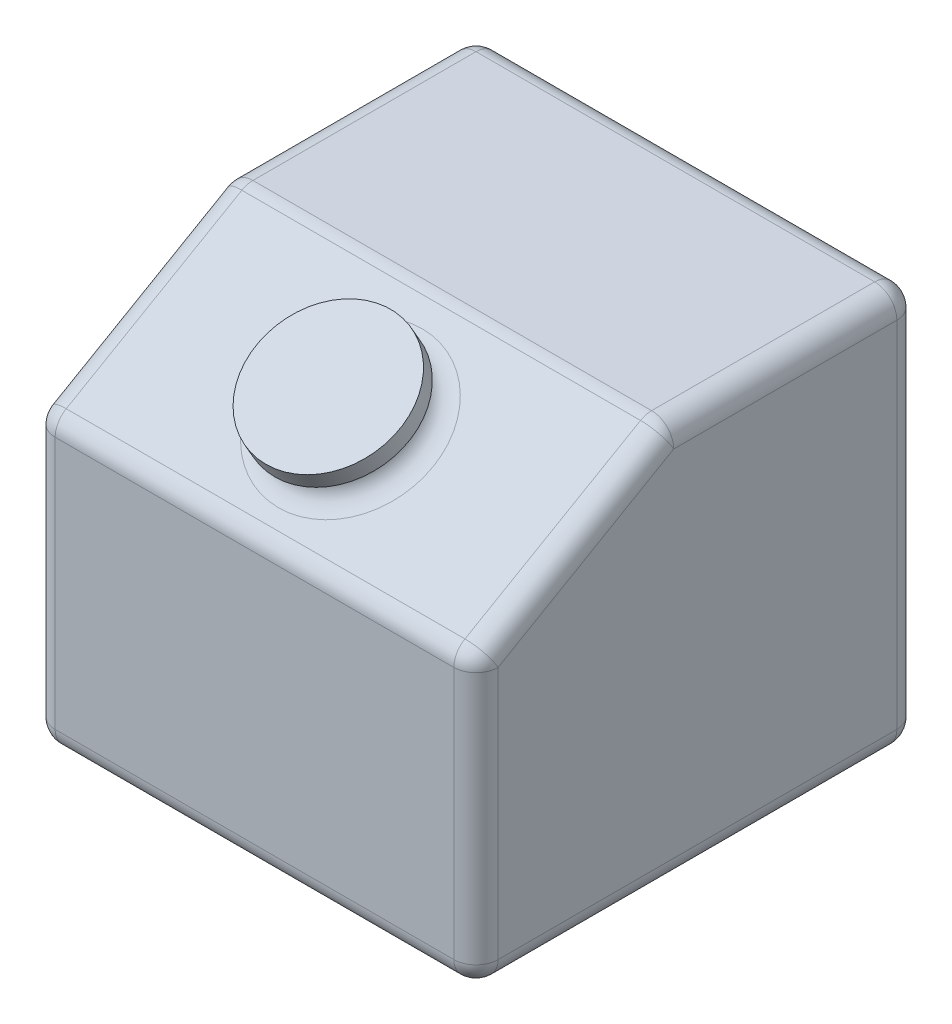
ISO-10303-21;
HEADER;
FILE_DESCRIPTION(('STEP AP214'),'2;1');
FILE_NAME('part.step','',(''),(''),'','','');
FILE_SCHEMA(('AUTOMOTIVE_DESIGN { 1 0 10303 214 1 1 1 1 }'));
ENDSEC;
DATA;
#1=APPLICATION_CONTEXT('core data for automotive mechanical design processes');
#2=APPLICATION_PROTOCOL_DEFINITION('international standard','automotive_design',2000,#1);
#3=PRODUCT_CONTEXT('',#1,'mechanical');
#4=PRODUCT('Part','Part','',(#3));
#5=PRODUCT_RELATED_PRODUCT_CATEGORY('part','',(#4));
#6=PRODUCT_DEFINITION_FORMATION('','',#4);
#7=PRODUCT_DEFINITION_CONTEXT('part definition',#1,'design');
#8=PRODUCT_DEFINITION('design','',#6,#7);
#9=PRODUCT_DEFINITION_SHAPE('','',#8);
#10=(LENGTH_UNIT() NAMED_UNIT(*) SI_UNIT(.MILLI.,.METRE.));
#11=(NAMED_UNIT(*) PLANE_ANGLE_UNIT() SI_UNIT($,.RADIAN.));
#12=(NAMED_UNIT(*) SI_UNIT($,.STERADIAN.) SOLID_ANGLE_UNIT());
#13=UNCERTAINTY_MEASURE_WITH_UNIT(LENGTH_MEASURE(1.E-05),#10,'distance_accuracy_value','');
#14=(GEOMETRIC_REPRESENTATION_CONTEXT(3) GLOBAL_UNCERTAINTY_ASSIGNED_CONTEXT((#13)) GLOBAL_UNIT_ASSIGNED_CONTEXT((#10,
#11,#12)) REPRESENTATION_CONTEXT('',''));
#15=CARTESIAN_POINT('',(0.,0.,0.));
#16=DIRECTION('',(0.,0.,1.));
#17=DIRECTION('',(1.,0.,0.));
#18=AXIS2_PLACEMENT_3D('',#15,#16,#17);
#19=CARTESIAN_POINT('',(100.,172.320508075689,-33.3012701892218));
#20=DIRECTION('',(0.,-0.866025403784438,-0.500000000000001));
#21=DIRECTION('',(0.,0.500000000000001,-0.866025403784438));
#22=AXIS2_PLACEMENT_3D('',#19,#20,#21);
#23=CYLINDRICAL_SURFACE('',#22,27.5);
#24=CARTESIAN_POINT('',(100.,163.660254037844,-38.3012701892219));
#25=DIRECTION('',(0.,-0.866025403784438,-0.500000000000001));
#26=DIRECTION('',(0.,0.500000000000001,-0.866025403784438));
#27=AXIS2_PLACEMENT_3D('',#24,#25,#26);
#28=CIRCLE('',#27,27.5);
#29=CARTESIAN_POINT('',(100.,177.410254037844,-62.1169687932939));
#30=VERTEX_POINT('',#29);
#31=EDGE_CURVE('E232',#30,#30,#28,.F.);
#32=ORIENTED_EDGE('',*,*,#31,.T.);
#33=EDGE_LOOP('',(#32));
#34=FACE_BOUND('',#33,.T.);
#35=CARTESIAN_POINT('',(100.,165.392304845413,-37.3012701892219));
#36=DIRECTION('',(0.,0.866025403784438,0.500000000000001));
#37=DIRECTION('',(0.,-0.500000000000001,0.866025403784438));
#38=AXIS2_PLACEMENT_3D('',#35,#36,#37);
#39=CIRCLE('',#38,27.5);
#40=CARTESIAN_POINT('',(100.,151.642304845413,-13.4855715851498));
#41=VERTEX_POINT('',#40);
#42=EDGE_CURVE('E226',#41,#41,#39,.T.);
#43=ORIENTED_EDGE('',*,*,#42,.F.);
#44=EDGE_LOOP('',(#43));
#45=FACE_BOUND('',#44,.T.);
#46=ADVANCED_FACE('F36',(#34,#45),#23,.T.);
#47=CARTESIAN_POINT('',(0.,180.,0.));
#48=DIRECTION('',(1.,0.,0.));
#49=DIRECTION('',(0.,0.,-1.));
#50=AXIS2_PLACEMENT_3D('',#47,#48,#49);
#51=PLANE('',#50);
#52=DIRECTION('',(0.,-0.500000000000001,0.866025403784438));
#53=VECTOR('',#52,1.);
#54=CARTESIAN_POINT('',(0.,171.339745962156,-91.6025403784437));
#55=LINE('',#54,#53);
#56=CARTESIAN_POINT('',(0.,124.226497308104,-10.));
#57=VERTEX_POINT('',#56);
#58=CARTESIAN_POINT('',(0.,170.,-89.2820323027549));
#59=VERTEX_POINT('',#58);
#60=EDGE_CURVE('E262',#57,#59,#55,.F.);
#61=ORIENTED_EDGE('',*,*,#60,.T.);
#62=DIRECTION('',(0.,0.,1.));
#63=VECTOR('',#62,1.);
#64=CARTESIAN_POINT('',(0.,170.,0.));
#65=LINE('',#64,#63);
#66=CARTESIAN_POINT('',(0.,170.,-190.));
#67=VERTEX_POINT('',#66);
#68=EDGE_CURVE('E264',#59,#67,#65,.F.);
#69=ORIENTED_EDGE('',*,*,#68,.T.);
#70=DIRECTION('',(0.,-1.,0.));
#71=VECTOR('',#70,1.);
#72=CARTESIAN_POINT('',(0.,180.,-190.));
#73=LINE('',#72,#71);
#74=CARTESIAN_POINT('',(0.,10.,-190.));
#75=VERTEX_POINT('',#74);
#76=EDGE_CURVE('E260',#67,#75,#73,.T.);
#77=ORIENTED_EDGE('',*,*,#76,.T.);
#78=DIRECTION('',(0.,0.,1.));
#79=VECTOR('',#78,1.);
#80=CARTESIAN_POINT('',(0.,10.,0.));
#81=LINE('',#80,#79);
#82=CARTESIAN_POINT('',(0.,10.,-10.));
#83=VERTEX_POINT('',#82);
#84=EDGE_CURVE('E256',#75,#83,#81,.T.);
#85=ORIENTED_EDGE('',*,*,#84,.T.);
#86=DIRECTION('',(0.,-1.,0.));
#87=VECTOR('',#86,1.);
#88=CARTESIAN_POINT('',(0.,180.,-10.));
#89=LINE('',#88,#87);
#90=EDGE_CURVE('E258',#83,#57,#89,.F.);
#91=ORIENTED_EDGE('',*,*,#90,.T.);
#92=EDGE_LOOP('',(#61,#69,#77,#85,#91));
#93=FACE_BOUND('',#92,.T.);
#94=ADVANCED_FACE('F414',(#93),#51,.F.);
#95=CARTESIAN_POINT('',(0.,180.,0.));
#96=DIRECTION('',(0.,0.,-1.));
#97=DIRECTION('',(-1.,0.,0.));
#98=AXIS2_PLACEMENT_3D('',#95,#96,#97);
#99=PLANE('',#98);
#100=DIRECTION('',(1.,0.,0.));
#101=VECTOR('',#100,1.);
#102=CARTESIAN_POINT('',(0.,124.226497308104,0.));
#103=LINE('',#102,#101);
#104=CARTESIAN_POINT('',(190.,124.226497308104,0.));
#105=VERTEX_POINT('',#104);
#106=CARTESIAN_POINT('',(10.,124.226497308104,0.));
#107=VERTEX_POINT('',#106);
#108=EDGE_CURVE('E291',#105,#107,#103,.F.);
#109=ORIENTED_EDGE('',*,*,#108,.T.);
#110=DIRECTION('',(0.,-1.,0.));
#111=VECTOR('',#110,1.);
#112=CARTESIAN_POINT('',(10.,180.,0.));
#113=LINE('',#112,#111);
#114=CARTESIAN_POINT('',(10.,10.,0.));
#115=VERTEX_POINT('',#114);
#116=EDGE_CURVE('E293',#107,#115,#113,.T.);
#117=ORIENTED_EDGE('',*,*,#116,.T.);
#118=DIRECTION('',(1.,0.,0.));
#119=VECTOR('',#118,1.);
#120=CARTESIAN_POINT('',(200.,10.,0.));
#121=LINE('',#120,#119);
#122=CARTESIAN_POINT('',(190.,10.,0.));
#123=VERTEX_POINT('',#122);
#124=EDGE_CURVE('E287',#115,#123,#121,.T.);
#125=ORIENTED_EDGE('',*,*,#124,.T.);
#126=DIRECTION('',(0.,-1.,0.));
#127=VECTOR('',#126,1.);
#128=CARTESIAN_POINT('',(190.,180.,0.));
#129=LINE('',#128,#127);
#130=EDGE_CURVE('E289',#123,#105,#129,.F.);
#131=ORIENTED_EDGE('',*,*,#130,.T.);
#132=EDGE_LOOP('',(#109,#117,#125,#131));
#133=FACE_BOUND('',#132,.T.);
#134=ADVANCED_FACE('F393',(#133),#99,.F.);
#135=CARTESIAN_POINT('',(200.,180.,0.));
#136=DIRECTION('',(-1.,0.,0.));
#137=DIRECTION('',(0.,0.,1.));
#138=AXIS2_PLACEMENT_3D('',#135,#136,#137);
#139=PLANE('',#138);
#140=DIRECTION('',(0.,-1.,0.));
#141=VECTOR('',#140,1.);
#142=CARTESIAN_POINT('',(200.,180.,-190.));
#143=LINE('',#142,#141);
#144=CARTESIAN_POINT('',(200.,10.,-190.));
#145=VERTEX_POINT('',#144);
#146=CARTESIAN_POINT('',(200.,170.,-190.));
#147=VERTEX_POINT('',#146);
#148=EDGE_CURVE('E282',#145,#147,#143,.F.);
#149=ORIENTED_EDGE('',*,*,#148,.T.);
#150=DIRECTION('',(0.,0.,-1.));
#151=VECTOR('',#150,1.);
#152=CARTESIAN_POINT('',(200.,170.,0.));
#153=LINE('',#152,#151);
#154=CARTESIAN_POINT('',(200.,170.,-89.282032302755));
#155=VERTEX_POINT('',#154);
#156=EDGE_CURVE('E285',#147,#155,#153,.F.);
#157=ORIENTED_EDGE('',*,*,#156,.T.);
#158=DIRECTION('',(0.,0.500000000000001,-0.866025403784438));
#159=VECTOR('',#158,1.);
#160=CARTESIAN_POINT('',(200.,121.339745962156,-5.));
#161=LINE('',#160,#159);
#162=CARTESIAN_POINT('',(200.,124.226497308104,-10.));
#163=VERTEX_POINT('',#162);
#164=EDGE_CURVE('E280',#155,#163,#161,.F.);
#165=ORIENTED_EDGE('',*,*,#164,.T.);
#166=DIRECTION('',(0.,-1.,0.));
#167=VECTOR('',#166,1.);
#168=CARTESIAN_POINT('',(200.,180.,-10.));
#169=LINE('',#168,#167);
#170=CARTESIAN_POINT('',(200.,10.,-10.));
#171=VERTEX_POINT('',#170);
#172=EDGE_CURVE('E278',#163,#171,#169,.T.);
#173=ORIENTED_EDGE('',*,*,#172,.T.);
#174=DIRECTION('',(0.,0.,-1.));
#175=VECTOR('',#174,1.);
#176=CARTESIAN_POINT('',(200.,10.,-200.));
#177=LINE('',#176,#175);
#178=EDGE_CURVE('E276',#171,#145,#177,.T.);
#179=ORIENTED_EDGE('',*,*,#178,.T.);
#180=EDGE_LOOP('',(#149,#157,#165,#173,#179));
#181=FACE_BOUND('',#180,.T.);
#182=ADVANCED_FACE('F491',(#181),#139,.F.);
#183=CARTESIAN_POINT('',(0.,180.,-200.));
#184=DIRECTION('',(0.,0.,1.));
#185=DIRECTION('',(1.,0.,0.));
#186=AXIS2_PLACEMENT_3D('',#183,#184,#185);
#187=PLANE('',#186);
#188=DIRECTION('',(0.,-1.,0.));
#189=VECTOR('',#188,1.);
#190=CARTESIAN_POINT('',(10.,180.,-200.));
#191=LINE('',#190,#189);
#192=CARTESIAN_POINT('',(10.,10.,-200.));
#193=VERTEX_POINT('',#192);
#194=CARTESIAN_POINT('',(10.,170.,-200.));
#195=VERTEX_POINT('',#194);
#196=EDGE_CURVE('E271',#193,#195,#191,.F.);
#197=ORIENTED_EDGE('',*,*,#196,.T.);
#198=DIRECTION('',(-1.,0.,0.));
#199=VECTOR('',#198,1.);
#200=CARTESIAN_POINT('',(0.,170.,-200.));
#201=LINE('',#200,#199);
#202=CARTESIAN_POINT('',(190.,170.,-200.));
#203=VERTEX_POINT('',#202);
#204=EDGE_CURVE('E273',#195,#203,#201,.F.);
#205=ORIENTED_EDGE('',*,*,#204,.T.);
#206=DIRECTION('',(0.,-1.,0.));
#207=VECTOR('',#206,1.);
#208=CARTESIAN_POINT('',(190.,180.,-200.));
#209=LINE('',#208,#207);
#210=CARTESIAN_POINT('',(190.,10.,-200.));
#211=VERTEX_POINT('',#210);
#212=EDGE_CURVE('E269',#203,#211,#209,.T.);
#213=ORIENTED_EDGE('',*,*,#212,.T.);
#214=DIRECTION('',(-1.,0.,0.));
#215=VECTOR('',#214,1.);
#216=CARTESIAN_POINT('',(0.,10.,-200.));
#217=LINE('',#216,#215);
#218=EDGE_CURVE('E267',#211,#193,#217,.T.);
#219=ORIENTED_EDGE('',*,*,#218,.T.);
#220=EDGE_LOOP('',(#197,#205,#213,#219));
#221=FACE_BOUND('',#220,.T.);
#222=ADVANCED_FACE('F486',(#221),#187,.F.);
#223=CARTESIAN_POINT('',(0.,180.,0.));
#224=DIRECTION('',(0.,-1.,0.));
#225=DIRECTION('',(0.,0.,-1.));
#226=AXIS2_PLACEMENT_3D('',#223,#224,#225);
#227=PLANE('',#226);
#228=DIRECTION('',(0.,0.,1.));
#229=VECTOR('',#228,1.);
#230=CARTESIAN_POINT('',(10.,180.,0.));
#231=LINE('',#230,#229);
#232=CARTESIAN_POINT('',(10.,180.,-190.));
#233=VERTEX_POINT('',#232);
#234=CARTESIAN_POINT('',(10.,180.,-89.282032302755));
#235=VERTEX_POINT('',#234);
#236=EDGE_CURVE('E251',#233,#235,#231,.T.);
#237=ORIENTED_EDGE('',*,*,#236,.T.);
#238=DIRECTION('',(-1.,0.,0.));
#239=VECTOR('',#238,1.);
#240=CARTESIAN_POINT('',(200.,180.,-89.282032302755));
#241=LINE('',#240,#239);
#242=CARTESIAN_POINT('',(190.,180.,-89.282032302755));
#243=VERTEX_POINT('',#242);
#244=EDGE_CURVE('E253',#235,#243,#241,.F.);
#245=ORIENTED_EDGE('',*,*,#244,.T.);
#246=DIRECTION('',(0.,0.,-1.));
#247=VECTOR('',#246,1.);
#248=CARTESIAN_POINT('',(190.,180.,0.));
#249=LINE('',#248,#247);
#250=CARTESIAN_POINT('',(190.,180.,-190.));
#251=VERTEX_POINT('',#250);
#252=EDGE_CURVE('E247',#243,#251,#249,.T.);
#253=ORIENTED_EDGE('',*,*,#252,.T.);
#254=DIRECTION('',(-1.,0.,0.));
#255=VECTOR('',#254,1.);
#256=CARTESIAN_POINT('',(0.,180.,-190.));
#257=LINE('',#256,#255);
#258=EDGE_CURVE('E249',#251,#233,#257,.T.);
#259=ORIENTED_EDGE('',*,*,#258,.T.);
#260=EDGE_LOOP('',(#237,#245,#253,#259));
#261=FACE_BOUND('',#260,.T.);
#262=ADVANCED_FACE('F479',(#261),#227,.F.);
#263=CARTESIAN_POINT('',(0.,0.,0.));
#264=DIRECTION('',(0.,-1.,0.));
#265=DIRECTION('',(0.,0.,-1.));
#266=AXIS2_PLACEMENT_3D('',#263,#264,#265);
#267=PLANE('',#266);
#268=DIRECTION('',(0.,0.,-1.));
#269=VECTOR('',#268,1.);
#270=CARTESIAN_POINT('',(190.,0.,0.));
#271=LINE('',#270,#269);
#272=CARTESIAN_POINT('',(190.,0.,-190.));
#273=VERTEX_POINT('',#272);
#274=CARTESIAN_POINT('',(190.,0.,-10.));
#275=VERTEX_POINT('',#274);
#276=EDGE_CURVE('E45',#273,#275,#271,.F.);
#277=ORIENTED_EDGE('',*,*,#276,.T.);
#278=DIRECTION('',(1.,0.,0.));
#279=VECTOR('',#278,1.);
#280=CARTESIAN_POINT('',(0.,0.,-10.));
#281=LINE('',#280,#279);
#282=CARTESIAN_POINT('',(10.,0.,-10.));
#283=VERTEX_POINT('',#282);
#284=EDGE_CURVE('E11',#275,#283,#281,.F.);
#285=ORIENTED_EDGE('',*,*,#284,.T.);
#286=DIRECTION('',(0.,0.,1.));
#287=VECTOR('',#286,1.);
#288=CARTESIAN_POINT('',(10.,0.,-200.));
#289=LINE('',#288,#287);
#290=CARTESIAN_POINT('',(10.,0.,-190.));
#291=VERTEX_POINT('',#290);
#292=EDGE_CURVE('E296',#283,#291,#289,.F.);
#293=ORIENTED_EDGE('',*,*,#292,.T.);
#294=DIRECTION('',(-1.,0.,0.));
#295=VECTOR('',#294,1.);
#296=CARTESIAN_POINT('',(200.,0.,-190.));
#297=LINE('',#296,#295);
#298=EDGE_CURVE('E56',#291,#273,#297,.F.);
#299=ORIENTED_EDGE('',*,*,#298,.T.);
#300=EDGE_LOOP('',(#277,#285,#293,#299));
#301=FACE_BOUND('',#300,.T.);
#302=ADVANCED_FACE('F516',(#301),#267,.T.);
#303=CARTESIAN_POINT('',(0.,180.,-86.6025403784437));
#304=DIRECTION('',(0.,-0.866025403784438,-0.500000000000001));
#305=DIRECTION('',(1.,0.,0.));
#306=AXIS2_PLACEMENT_3D('',#303,#304,#305);
#307=PLANE('',#306);
#308=CARTESIAN_POINT('',(100.,155.,-43.3012701892219));
#309=DIRECTION('',(0.,-0.866025403784438,-0.500000000000001));
#310=DIRECTION('',(0.,0.500000000000001,-0.866025403784438));
#311=AXIS2_PLACEMENT_3D('',#308,#309,#310);
#312=CIRCLE('',#311,37.5);
#313=CARTESIAN_POINT('',(100.,173.75,-75.7772228311383));
#314=VERTEX_POINT('',#313);
#315=EDGE_CURVE('E244',#314,#314,#312,.T.);
#316=ORIENTED_EDGE('',*,*,#315,.T.);
#317=EDGE_LOOP('',(#316));
#318=FACE_BOUND('',#317,.T.);
#319=DIRECTION('',(0.,-0.500000000000001,0.866025403784438));
#320=VECTOR('',#319,1.);
#321=CARTESIAN_POINT('',(190.,180.,-86.6025403784437));
#322=LINE('',#321,#320);
#323=CARTESIAN_POINT('',(190.,132.886751345948,-4.99999999999998));
#324=VERTEX_POINT('',#323);
#325=CARTESIAN_POINT('',(190.,178.660254037844,-84.2820323027549));
#326=VERTEX_POINT('',#325);
#327=EDGE_CURVE('E237',#324,#326,#322,.F.);
#328=ORIENTED_EDGE('',*,*,#327,.T.);
#329=DIRECTION('',(1.,0.,0.));
#330=VECTOR('',#329,1.);
#331=CARTESIAN_POINT('',(0.,178.660254037844,-84.2820323027549));
#332=LINE('',#331,#330);
#333=CARTESIAN_POINT('',(10.,178.660254037844,-84.2820323027549));
#334=VERTEX_POINT('',#333);
#335=EDGE_CURVE('E241',#326,#334,#332,.F.);
#336=ORIENTED_EDGE('',*,*,#335,.T.);
#337=DIRECTION('',(0.,0.500000000000001,-0.866025403784438));
#338=VECTOR('',#337,1.);
#339=CARTESIAN_POINT('',(10.,130.,0.));
#340=LINE('',#339,#338);
#341=CARTESIAN_POINT('',(10.,132.886751345948,-4.99999999999998));
#342=VERTEX_POINT('',#341);
#343=EDGE_CURVE('E239',#334,#342,#340,.F.);
#344=ORIENTED_EDGE('',*,*,#343,.T.);
#345=DIRECTION('',(-1.,0.,0.));
#346=VECTOR('',#345,1.);
#347=CARTESIAN_POINT('',(200.,132.886751345948,-4.99999999999998));
#348=LINE('',#347,#346);
#349=EDGE_CURVE('E235',#342,#324,#348,.F.);
#350=ORIENTED_EDGE('',*,*,#349,.T.);
#351=EDGE_LOOP('',(#328,#336,#344,#350));
#352=FACE_BOUND('',#351,.T.);
#353=ADVANCED_FACE('F465',(#318,#352),#307,.F.);
#354=CARTESIAN_POINT('',(100.,165.392304845413,-37.3012701892218));
#355=DIRECTION('',(0.,0.866025403784438,0.500000000000001));
#356=DIRECTION('',(0.,-0.500000000000001,0.866025403784438));
#357=AXIS2_PLACEMENT_3D('',#354,#355,#356);
#358=CYLINDRICAL_SURFACE('',#357,32.5);
#359=CARTESIAN_POINT('',(100.,165.392304845413,-37.3012701892218));
#360=DIRECTION('',(0.,0.866025403784438,0.500000000000001));
#361=DIRECTION('',(0.,-0.500000000000001,0.866025403784438));
#362=AXIS2_PLACEMENT_3D('',#359,#360,#361);
#363=CIRCLE('',#362,32.5);
#364=CARTESIAN_POINT('',(100.,149.142304845413,-9.15544456622762));
#365=VERTEX_POINT('',#364);
#366=EDGE_CURVE('E223',#365,#365,#363,.T.);
#367=ORIENTED_EDGE('',*,*,#366,.T.);
#368=EDGE_LOOP('',(#367));
#369=FACE_BOUND('',#368,.T.);
#370=CARTESIAN_POINT('',(100.,172.320508075689,-33.3012701892218));
#371=DIRECTION('',(0.,0.866025403784438,0.500000000000001));
#372=DIRECTION('',(0.,-0.500000000000001,0.866025403784438));
#373=AXIS2_PLACEMENT_3D('',#370,#371,#372);
#374=CIRCLE('',#373,32.5);
#375=CARTESIAN_POINT('',(100.,156.070508075689,-5.15544456622761));
#376=VERTEX_POINT('',#375);
#377=EDGE_CURVE('E227',#376,#376,#374,.T.);
#378=ORIENTED_EDGE('',*,*,#377,.F.);
#379=EDGE_LOOP('',(#378));
#380=FACE_BOUND('',#379,.T.);
#381=ADVANCED_FACE('F527',(#369,#380),#358,.T.);
#382=CARTESIAN_POINT('',(100.,165.392304845413,-37.3012701892218));
#383=DIRECTION('',(0.,0.866025403784438,0.500000000000001));
#384=DIRECTION('',(0.,-0.500000000000001,0.866025403784438));
#385=AXIS2_PLACEMENT_3D('',#382,#383,#384);
#386=PLANE('',#385);
#387=ORIENTED_EDGE('',*,*,#42,.T.);
#388=EDGE_LOOP('',(#387));
#389=FACE_BOUND('',#388,.T.);
#390=ORIENTED_EDGE('',*,*,#366,.F.);
#391=EDGE_LOOP('',(#390));
#392=FACE_BOUND('',#391,.T.);
#393=ADVANCED_FACE('F786',(#389,#392),#386,.F.);
#394=CARTESIAN_POINT('',(0.,114.820508075689,66.2916512459886));
#395=DIRECTION('',(0.,0.866025403784438,0.500000000000001));
#396=DIRECTION('',(0.,-0.500000000000002,0.866025403784438));
#397=AXIS2_PLACEMENT_3D('',#394,#395,#396);
#398=PLANE('',#397);
#399=ORIENTED_EDGE('',*,*,#377,.T.);
#400=EDGE_LOOP('',(#399));
#401=FACE_BOUND('',#400,.T.);
#402=ADVANCED_FACE('F512',(#401),#398,.T.);
#403=CARTESIAN_POINT('',(100.,163.660254037844,-38.3012701892219));
#404=DIRECTION('',(0.,-0.866025403784438,-0.500000000000001));
#405=DIRECTION('',(0.,0.500000000000001,-0.866025403784438));
#406=AXIS2_PLACEMENT_3D('',#403,#404,#405);
#407=TOROIDAL_SURFACE('',#406,37.5,10.);
#408=ORIENTED_EDGE('',*,*,#315,.F.);
#409=EDGE_LOOP('',(#408));
#410=FACE_BOUND('',#409,.T.);
#411=ORIENTED_EDGE('',*,*,#31,.F.);
#412=EDGE_LOOP('',(#411));
#413=FACE_BOUND('',#412,.T.);
#414=ADVANCED_FACE('F529',(#410,#413),#407,.F.);
#415=CARTESIAN_POINT('',(10.,10.,0.));
#416=DIRECTION('',(0.,0.,-1.));
#417=DIRECTION('',(-1.,0.,0.));
#418=AXIS2_PLACEMENT_3D('',#415,#416,#417);
#419=CYLINDRICAL_SURFACE('',#418,10.);
#420=CARTESIAN_POINT('',(10.,10.,-190.));
#421=DIRECTION('',(0.,0.,-1.));
#422=DIRECTION('',(-1.,0.,0.));
#423=AXIS2_PLACEMENT_3D('',#420,#421,#422);
#424=CIRCLE('',#423,10.);
#425=EDGE_CURVE('E375',#291,#75,#424,.T.);
#426=ORIENTED_EDGE('',*,*,#425,.F.);
#427=ORIENTED_EDGE('',*,*,#292,.F.);
#428=CARTESIAN_POINT('',(10.,10.,-10.));
#429=DIRECTION('',(0.,0.,1.));
#430=DIRECTION('',(1.,0.,0.));
#431=AXIS2_PLACEMENT_3D('',#428,#429,#430);
#432=CIRCLE('',#431,10.);
#433=EDGE_CURVE('E377',#83,#283,#432,.T.);
#434=ORIENTED_EDGE('',*,*,#433,.F.);
#435=ORIENTED_EDGE('',*,*,#84,.F.);
#436=EDGE_LOOP('',(#426,#427,#434,#435));
#437=FACE_BOUND('',#436,.T.);
#438=ADVANCED_FACE('F38',(#437),#419,.T.);
#439=CARTESIAN_POINT('',(0.,10.,-190.));
#440=DIRECTION('',(1.,0.,0.));
#441=DIRECTION('',(0.,0.,-1.));
#442=AXIS2_PLACEMENT_3D('',#439,#440,#441);
#443=CYLINDRICAL_SURFACE('',#442,10.);
#444=CARTESIAN_POINT('',(190.,10.,-190.));
#445=DIRECTION('',(1.,0.,0.));
#446=DIRECTION('',(0.,0.,-1.));
#447=AXIS2_PLACEMENT_3D('',#444,#445,#446);
#448=CIRCLE('',#447,10.);
#449=EDGE_CURVE('E369',#273,#211,#448,.T.);
#450=ORIENTED_EDGE('',*,*,#449,.F.);
#451=ORIENTED_EDGE('',*,*,#298,.F.);
#452=CARTESIAN_POINT('',(10.,10.,-190.));
#453=DIRECTION('',(-1.,0.,0.));
#454=DIRECTION('',(0.,0.,1.));
#455=AXIS2_PLACEMENT_3D('',#452,#453,#454);
#456=CIRCLE('',#455,10.);
#457=EDGE_CURVE('E372',#193,#291,#456,.T.);
#458=ORIENTED_EDGE('',*,*,#457,.F.);
#459=ORIENTED_EDGE('',*,*,#218,.F.);
#460=EDGE_LOOP('',(#450,#451,#458,#459));
#461=FACE_BOUND('',#460,.T.);
#462=ADVANCED_FACE('F439',(#461),#443,.T.);
#463=CARTESIAN_POINT('',(190.,10.,0.));
#464=DIRECTION('',(0.,0.,1.));
#465=DIRECTION('',(1.,0.,0.));
#466=AXIS2_PLACEMENT_3D('',#463,#464,#465);
#467=CYLINDRICAL_SURFACE('',#466,10.);
#468=CARTESIAN_POINT('',(190.,10.,-10.));
#469=DIRECTION('',(0.,0.,1.));
#470=DIRECTION('',(1.,0.,0.));
#471=AXIS2_PLACEMENT_3D('',#468,#469,#470);
#472=CIRCLE('',#471,10.);
#473=EDGE_CURVE('E363',#275,#171,#472,.T.);
#474=ORIENTED_EDGE('',*,*,#473,.F.);
#475=ORIENTED_EDGE('',*,*,#276,.F.);
#476=CARTESIAN_POINT('',(190.,10.,-190.));
#477=DIRECTION('',(0.,0.,-1.));
#478=DIRECTION('',(-1.,0.,0.));
#479=AXIS2_PLACEMENT_3D('',#476,#477,#478);
#480=CIRCLE('',#479,10.);
#481=EDGE_CURVE('E366',#145,#273,#480,.T.);
#482=ORIENTED_EDGE('',*,*,#481,.F.);
#483=ORIENTED_EDGE('',*,*,#178,.F.);
#484=EDGE_LOOP('',(#474,#475,#482,#483));
#485=FACE_BOUND('',#484,.T.);
#486=ADVANCED_FACE('F448',(#485),#467,.T.);
#487=CARTESIAN_POINT('',(0.,10.,-10.));
#488=DIRECTION('',(-1.,0.,0.));
#489=DIRECTION('',(0.,0.,1.));
#490=AXIS2_PLACEMENT_3D('',#487,#488,#489);
#491=CYLINDRICAL_SURFACE('',#490,10.);
#492=CARTESIAN_POINT('',(10.,10.,-10.));
#493=DIRECTION('',(-1.,0.,0.));
#494=DIRECTION('',(0.,0.,1.));
#495=AXIS2_PLACEMENT_3D('',#492,#493,#494);
#496=CIRCLE('',#495,10.);
#497=EDGE_CURVE('E40',#283,#115,#496,.T.);
#498=ORIENTED_EDGE('',*,*,#497,.F.);
#499=ORIENTED_EDGE('',*,*,#284,.F.);
#500=CARTESIAN_POINT('',(190.,10.,-10.));
#501=DIRECTION('',(1.,0.,0.));
#502=DIRECTION('',(0.,0.,-1.));
#503=AXIS2_PLACEMENT_3D('',#500,#501,#502);
#504=CIRCLE('',#503,10.);
#505=EDGE_CURVE('E360',#123,#275,#504,.T.);
#506=ORIENTED_EDGE('',*,*,#505,.F.);
#507=ORIENTED_EDGE('',*,*,#124,.F.);
#508=EDGE_LOOP('',(#498,#499,#506,#507));
#509=FACE_BOUND('',#508,.T.);
#510=ADVANCED_FACE('F389',(#509),#491,.T.);
#511=CARTESIAN_POINT('',(10.,10.,-10.));
#512=DIRECTION('',(0.,0.,1.));
#513=DIRECTION('',(1.,0.,0.));
#514=AXIS2_PLACEMENT_3D('',#511,#512,#513);
#515=SPHERICAL_SURFACE('',#514,10.);
#516=ORIENTED_EDGE('',*,*,#433,.T.);
#517=ORIENTED_EDGE('',*,*,#497,.T.);
#518=CARTESIAN_POINT('',(10.,10.,-10.));
#519=DIRECTION('',(0.,-1.,0.));
#520=DIRECTION('',(0.,0.,-1.));
#521=AXIS2_PLACEMENT_3D('',#518,#519,#520);
#522=CIRCLE('',#521,10.);
#523=EDGE_CURVE('E358',#83,#115,#522,.F.);
#524=ORIENTED_EDGE('',*,*,#523,.F.);
#525=EDGE_LOOP('',(#516,#517,#524));
#526=FACE_BOUND('',#525,.T.);
#527=ADVANCED_FACE('F384',(#526),#515,.T.);
#528=CARTESIAN_POINT('',(10.,10.,-190.));
#529=DIRECTION('',(0.,0.,1.));
#530=DIRECTION('',(1.,0.,0.));
#531=AXIS2_PLACEMENT_3D('',#528,#529,#530);
#532=SPHERICAL_SURFACE('',#531,10.);
#533=ORIENTED_EDGE('',*,*,#457,.T.);
#534=ORIENTED_EDGE('',*,*,#425,.T.);
#535=CARTESIAN_POINT('',(10.,10.,-190.));
#536=DIRECTION('',(0.,-1.,0.));
#537=DIRECTION('',(0.,0.,-1.));
#538=AXIS2_PLACEMENT_3D('',#535,#536,#537);
#539=CIRCLE('',#538,10.);
#540=EDGE_CURVE('E355',#193,#75,#539,.F.);
#541=ORIENTED_EDGE('',*,*,#540,.F.);
#542=EDGE_LOOP('',(#533,#534,#541));
#543=FACE_BOUND('',#542,.T.);
#544=ADVANCED_FACE('F434',(#543),#532,.T.);
#545=CARTESIAN_POINT('',(190.,10.,-190.));
#546=DIRECTION('',(0.,0.,1.));
#547=DIRECTION('',(1.,0.,0.));
#548=AXIS2_PLACEMENT_3D('',#545,#546,#547);
#549=SPHERICAL_SURFACE('',#548,10.);
#550=ORIENTED_EDGE('',*,*,#481,.T.);
#551=ORIENTED_EDGE('',*,*,#449,.T.);
#552=CARTESIAN_POINT('',(190.,10.,-190.));
#553=DIRECTION('',(0.,-1.,0.));
#554=DIRECTION('',(0.,0.,-1.));
#555=AXIS2_PLACEMENT_3D('',#552,#553,#554);
#556=CIRCLE('',#555,10.);
#557=EDGE_CURVE('E352',#145,#211,#556,.F.);
#558=ORIENTED_EDGE('',*,*,#557,.F.);
#559=EDGE_LOOP('',(#550,#551,#558));
#560=FACE_BOUND('',#559,.T.);
#561=ADVANCED_FACE('F443',(#560),#549,.T.);
#562=CARTESIAN_POINT('',(190.,10.,-10.));
#563=DIRECTION('',(0.,0.,1.));
#564=DIRECTION('',(1.,0.,0.));
#565=AXIS2_PLACEMENT_3D('',#562,#563,#564);
#566=SPHERICAL_SURFACE('',#565,10.);
#567=ORIENTED_EDGE('',*,*,#505,.T.);
#568=ORIENTED_EDGE('',*,*,#473,.T.);
#569=CARTESIAN_POINT('',(190.,10.,-10.));
#570=DIRECTION('',(0.,-1.,0.));
#571=DIRECTION('',(0.,0.,-1.));
#572=AXIS2_PLACEMENT_3D('',#569,#570,#571);
#573=CIRCLE('',#572,10.);
#574=EDGE_CURVE('E349',#123,#171,#573,.F.);
#575=ORIENTED_EDGE('',*,*,#574,.F.);
#576=EDGE_LOOP('',(#567,#568,#575));
#577=FACE_BOUND('',#576,.T.);
#578=ADVANCED_FACE('F450',(#577),#566,.T.);
#579=CARTESIAN_POINT('',(10.,180.,-10.));
#580=DIRECTION('',(0.,-1.,0.));
#581=DIRECTION('',(0.,0.,-1.));
#582=AXIS2_PLACEMENT_3D('',#579,#580,#581);
#583=CYLINDRICAL_SURFACE('',#582,10.);
#584=ORIENTED_EDGE('',*,*,#523,.T.);
#585=ORIENTED_EDGE('',*,*,#116,.F.);
#586=CARTESIAN_POINT('',(10.,124.226497308104,-10.));
#587=DIRECTION('',(0.,1.,0.));
#588=DIRECTION('',(0.,0.,1.));
#589=AXIS2_PLACEMENT_3D('',#586,#587,#588);
#590=CIRCLE('',#589,10.);
#591=EDGE_CURVE('E343',#57,#107,#590,.T.);
#592=ORIENTED_EDGE('',*,*,#591,.F.);
#593=ORIENTED_EDGE('',*,*,#90,.F.);
#594=EDGE_LOOP('',(#584,#585,#592,#593));
#595=FACE_BOUND('',#594,.T.);
#596=ADVANCED_FACE('F398',(#595),#583,.T.);
#597=CARTESIAN_POINT('',(10.,180.,-190.));
#598=DIRECTION('',(0.,-1.,0.));
#599=DIRECTION('',(0.,0.,-1.));
#600=AXIS2_PLACEMENT_3D('',#597,#598,#599);
#601=CYLINDRICAL_SURFACE('',#600,10.);
#602=ORIENTED_EDGE('',*,*,#540,.T.);
#603=ORIENTED_EDGE('',*,*,#76,.F.);
#604=CARTESIAN_POINT('',(10.,170.,-190.));
#605=DIRECTION('',(0.,1.,0.));
#606=DIRECTION('',(0.,0.,1.));
#607=AXIS2_PLACEMENT_3D('',#604,#605,#606);
#608=CIRCLE('',#607,10.);
#609=EDGE_CURVE('E340',#195,#67,#608,.T.);
#610=ORIENTED_EDGE('',*,*,#609,.F.);
#611=ORIENTED_EDGE('',*,*,#196,.F.);
#612=EDGE_LOOP('',(#602,#603,#610,#611));
#613=FACE_BOUND('',#612,.T.);
#614=ADVANCED_FACE('F428',(#613),#601,.T.);
#615=CARTESIAN_POINT('',(0.,170.,-190.));
#616=DIRECTION('',(-1.,0.,0.));
#617=DIRECTION('',(0.,0.,1.));
#618=AXIS2_PLACEMENT_3D('',#615,#616,#617);
#619=CYLINDRICAL_SURFACE('',#618,10.);
#620=CARTESIAN_POINT('',(190.,170.,-190.));
#621=DIRECTION('',(1.,0.,0.));
#622=DIRECTION('',(0.,0.,-1.));
#623=AXIS2_PLACEMENT_3D('',#620,#621,#622);
#624=CIRCLE('',#623,10.);
#625=EDGE_CURVE('E334',#203,#251,#624,.T.);
#626=ORIENTED_EDGE('',*,*,#625,.F.);
#627=ORIENTED_EDGE('',*,*,#204,.F.);
#628=CARTESIAN_POINT('',(10.,170.,-190.));
#629=DIRECTION('',(-1.,0.,0.));
#630=DIRECTION('',(0.,0.,1.));
#631=AXIS2_PLACEMENT_3D('',#628,#629,#630);
#632=CIRCLE('',#631,10.);
#633=EDGE_CURVE('E337',#233,#195,#632,.T.);
#634=ORIENTED_EDGE('',*,*,#633,.F.);
#635=ORIENTED_EDGE('',*,*,#258,.F.);
#636=EDGE_LOOP('',(#626,#627,#634,#635));
#637=FACE_BOUND('',#636,.T.);
#638=ADVANCED_FACE('F483',(#637),#619,.T.);
#639=CARTESIAN_POINT('',(190.,180.,-190.));
#640=DIRECTION('',(0.,-1.,0.));
#641=DIRECTION('',(0.,0.,-1.));
#642=AXIS2_PLACEMENT_3D('',#639,#640,#641);
#643=CYLINDRICAL_SURFACE('',#642,10.);
#644=ORIENTED_EDGE('',*,*,#557,.T.);
#645=ORIENTED_EDGE('',*,*,#212,.F.);
#646=CARTESIAN_POINT('',(190.,170.,-190.));
#647=DIRECTION('',(0.,1.,0.));
#648=DIRECTION('',(0.,0.,1.));
#649=AXIS2_PLACEMENT_3D('',#646,#647,#648);
#650=CIRCLE('',#649,10.);
#651=EDGE_CURVE('E332',#147,#203,#650,.T.);
#652=ORIENTED_EDGE('',*,*,#651,.F.);
#653=ORIENTED_EDGE('',*,*,#148,.F.);
#654=EDGE_LOOP('',(#644,#645,#652,#653));
#655=FACE_BOUND('',#654,.T.);
#656=ADVANCED_FACE('F489',(#655),#643,.T.);
#657=CARTESIAN_POINT('',(190.,180.,-10.));
#658=DIRECTION('',(0.,-1.,0.));
#659=DIRECTION('',(0.,0.,-1.));
#660=AXIS2_PLACEMENT_3D('',#657,#658,#659);
#661=CYLINDRICAL_SURFACE('',#660,10.);
#662=ORIENTED_EDGE('',*,*,#574,.T.);
#663=ORIENTED_EDGE('',*,*,#172,.F.);
#664=CARTESIAN_POINT('',(190.,124.226497308104,-10.));
#665=DIRECTION('',(0.,1.,0.));
#666=DIRECTION('',(-1.,0.,0.));
#667=AXIS2_PLACEMENT_3D('',#664,#665,#666);
#668=CIRCLE('',#667,10.);
#669=EDGE_CURVE('E329',#105,#163,#668,.T.);
#670=ORIENTED_EDGE('',*,*,#669,.F.);
#671=ORIENTED_EDGE('',*,*,#130,.F.);
#672=EDGE_LOOP('',(#662,#663,#670,#671));
#673=FACE_BOUND('',#672,.T.);
#674=ADVANCED_FACE('F454',(#673),#661,.T.);
#675=CARTESIAN_POINT('',(0.,124.226497308104,-10.));
#676=DIRECTION('',(-1.,0.,0.));
#677=DIRECTION('',(0.,0.,1.));
#678=AXIS2_PLACEMENT_3D('',#675,#676,#677);
#679=CYLINDRICAL_SURFACE('',#678,10.);
#680=CARTESIAN_POINT('',(10.,124.226497308104,-10.));
#681=DIRECTION('',(-1.,0.,0.));
#682=DIRECTION('',(0.,-1.,0.));
#683=AXIS2_PLACEMENT_3D('',#680,#681,#682);
#684=CIRCLE('',#683,10.);
#685=EDGE_CURVE('E346',#107,#342,#684,.T.);
#686=ORIENTED_EDGE('',*,*,#685,.F.);
#687=ORIENTED_EDGE('',*,*,#108,.F.);
#688=CARTESIAN_POINT('',(190.,124.226497308104,-9.99999999999999));
#689=DIRECTION('',(1.,0.,0.));
#690=DIRECTION('',(0.,0.,-1.));
#691=AXIS2_PLACEMENT_3D('',#688,#689,#690);
#692=CIRCLE('',#691,10.);
#693=EDGE_CURVE('E326',#324,#105,#692,.T.);
#694=ORIENTED_EDGE('',*,*,#693,.F.);
#695=ORIENTED_EDGE('',*,*,#349,.F.);
#696=EDGE_LOOP('',(#686,#687,#694,#695));
#697=FACE_BOUND('',#696,.T.);
#698=ADVANCED_FACE('F402',(#697),#679,.T.);
#699=CARTESIAN_POINT('',(10.,124.226497308104,-10.));
#700=DIRECTION('',(0.,0.,1.));
#701=DIRECTION('',(1.,0.,0.));
#702=AXIS2_PLACEMENT_3D('',#699,#700,#701);
#703=SPHERICAL_SURFACE('',#702,10.);
#704=ORIENTED_EDGE('',*,*,#591,.T.);
#705=ORIENTED_EDGE('',*,*,#685,.T.);
#706=CARTESIAN_POINT('',(10.,124.226497308104,-9.99999999999999));
#707=DIRECTION('',(0.,-0.500000000000002,0.866025403784438));
#708=DIRECTION('',(0.,-0.866025403784438,-0.500000000000002));
#709=AXIS2_PLACEMENT_3D('',#706,#707,#708);
#710=CIRCLE('',#709,10.);
#711=EDGE_CURVE('E323',#57,#342,#710,.F.);
#712=ORIENTED_EDGE('',*,*,#711,.F.);
#713=EDGE_LOOP('',(#704,#705,#712));
#714=FACE_BOUND('',#713,.T.);
#715=ADVANCED_FACE('F406',(#714),#703,.T.);
#716=CARTESIAN_POINT('',(10.,170.,-190.));
#717=DIRECTION('',(0.,0.,1.));
#718=DIRECTION('',(1.,0.,0.));
#719=AXIS2_PLACEMENT_3D('',#716,#717,#718);
#720=SPHERICAL_SURFACE('',#719,10.);
#721=ORIENTED_EDGE('',*,*,#633,.T.);
#722=ORIENTED_EDGE('',*,*,#609,.T.);
#723=CARTESIAN_POINT('',(10.,170.,-190.));
#724=DIRECTION('',(0.,0.,-1.));
#725=DIRECTION('',(-1.,0.,0.));
#726=AXIS2_PLACEMENT_3D('',#723,#724,#725);
#727=CIRCLE('',#726,10.);
#728=EDGE_CURVE('E321',#233,#67,#727,.F.);
#729=ORIENTED_EDGE('',*,*,#728,.F.);
#730=EDGE_LOOP('',(#721,#722,#729));
#731=FACE_BOUND('',#730,.T.);
#732=ADVANCED_FACE('F424',(#731),#720,.T.);
#733=CARTESIAN_POINT('',(190.,170.,-190.));
#734=DIRECTION('',(0.,0.,1.));
#735=DIRECTION('',(1.,0.,0.));
#736=AXIS2_PLACEMENT_3D('',#733,#734,#735);
#737=SPHERICAL_SURFACE('',#736,10.);
#738=ORIENTED_EDGE('',*,*,#651,.T.);
#739=ORIENTED_EDGE('',*,*,#625,.T.);
#740=CARTESIAN_POINT('',(190.,170.,-190.));
#741=DIRECTION('',(0.,0.,-1.));
#742=DIRECTION('',(-1.,0.,0.));
#743=AXIS2_PLACEMENT_3D('',#740,#741,#742);
#744=CIRCLE('',#743,10.);
#745=EDGE_CURVE('E318',#147,#251,#744,.F.);
#746=ORIENTED_EDGE('',*,*,#745,.F.);
#747=EDGE_LOOP('',(#738,#739,#746));
#748=FACE_BOUND('',#747,.T.);
#749=ADVANCED_FACE('F493',(#748),#737,.T.);
#750=CARTESIAN_POINT('',(190.,124.226497308104,-10.));
#751=DIRECTION('',(0.,0.,1.));
#752=DIRECTION('',(1.,0.,0.));
#753=AXIS2_PLACEMENT_3D('',#750,#751,#752);
#754=SPHERICAL_SURFACE('',#753,10.);
#755=ORIENTED_EDGE('',*,*,#693,.T.);
#756=ORIENTED_EDGE('',*,*,#669,.T.);
#757=CARTESIAN_POINT('',(190.,124.226497308104,-10.));
#758=DIRECTION('',(0.,-0.500000000000002,0.866025403784437));
#759=DIRECTION('',(0.,-0.866025403784437,-0.500000000000002));
#760=AXIS2_PLACEMENT_3D('',#757,#758,#759);
#761=CIRCLE('',#760,10.);
#762=EDGE_CURVE('E315',#324,#163,#761,.F.);
#763=ORIENTED_EDGE('',*,*,#762,.F.);
#764=EDGE_LOOP('',(#755,#756,#763));
#765=FACE_BOUND('',#764,.T.);
#766=ADVANCED_FACE('F457',(#765),#754,.T.);
#767=CARTESIAN_POINT('',(10.,133.839745962156,-26.6506350946111));
#768=DIRECTION('',(0.,0.500000000000001,-0.866025403784438));
#769=DIRECTION('',(0.,0.866025403784438,0.500000000000001));
#770=AXIS2_PLACEMENT_3D('',#767,#768,#769);
#771=CYLINDRICAL_SURFACE('',#770,10.);
#772=ORIENTED_EDGE('',*,*,#711,.T.);
#773=ORIENTED_EDGE('',*,*,#343,.F.);
#774=CARTESIAN_POINT('',(10.,170.,-89.2820323027549));
#775=DIRECTION('',(0.,0.500000000000001,-0.866025403784438));
#776=DIRECTION('',(0.,0.866025403784438,0.500000000000001));
#777=AXIS2_PLACEMENT_3D('',#774,#775,#776);
#778=CIRCLE('',#777,10.);
#779=EDGE_CURVE('E312',#59,#334,#778,.T.);
#780=ORIENTED_EDGE('',*,*,#779,.F.);
#781=ORIENTED_EDGE('',*,*,#60,.F.);
#782=EDGE_LOOP('',(#772,#773,#780,#781));
#783=FACE_BOUND('',#782,.T.);
#784=ADVANCED_FACE('F411',(#783),#771,.T.);
#785=CARTESIAN_POINT('',(10.,170.,0.));
#786=DIRECTION('',(0.,0.,1.));
#787=DIRECTION('',(1.,0.,0.));
#788=AXIS2_PLACEMENT_3D('',#785,#786,#787);
#789=CYLINDRICAL_SURFACE('',#788,10.);
#790=ORIENTED_EDGE('',*,*,#728,.T.);
#791=ORIENTED_EDGE('',*,*,#68,.F.);
#792=CARTESIAN_POINT('',(10.,170.,-89.282032302755));
#793=DIRECTION('',(0.,0.,1.));
#794=DIRECTION('',(1.,0.,0.));
#795=AXIS2_PLACEMENT_3D('',#792,#793,#794);
#796=CIRCLE('',#795,10.);
#797=EDGE_CURVE('E309',#235,#59,#796,.T.);
#798=ORIENTED_EDGE('',*,*,#797,.F.);
#799=ORIENTED_EDGE('',*,*,#236,.F.);
#800=EDGE_LOOP('',(#790,#791,#798,#799));
#801=FACE_BOUND('',#800,.T.);
#802=ADVANCED_FACE('F417',(#801),#789,.T.);
#803=CARTESIAN_POINT('',(190.,170.,0.));
#804=DIRECTION('',(0.,0.,-1.));
#805=DIRECTION('',(-1.,0.,0.));
#806=AXIS2_PLACEMENT_3D('',#803,#804,#805);
#807=CYLINDRICAL_SURFACE('',#806,10.);
#808=ORIENTED_EDGE('',*,*,#745,.T.);
#809=ORIENTED_EDGE('',*,*,#252,.F.);
#810=CARTESIAN_POINT('',(190.,170.,-89.282032302755));
#811=DIRECTION('',(0.,0.,1.));
#812=DIRECTION('',(1.,0.,0.));
#813=AXIS2_PLACEMENT_3D('',#810,#811,#812);
#814=CIRCLE('',#813,10.);
#815=EDGE_CURVE('E306',#155,#243,#814,.T.);
#816=ORIENTED_EDGE('',*,*,#815,.F.);
#817=ORIENTED_EDGE('',*,*,#156,.F.);
#818=EDGE_LOOP('',(#808,#809,#816,#817));
#819=FACE_BOUND('',#818,.T.);
#820=ADVANCED_FACE('F475',(#819),#807,.T.);
#821=CARTESIAN_POINT('',(190.,133.839745962156,-26.6506350946111));
#822=DIRECTION('',(0.,-0.500000000000001,0.866025403784438));
#823=DIRECTION('',(0.,-0.866025403784438,-0.500000000000001));
#824=AXIS2_PLACEMENT_3D('',#821,#822,#823);
#825=CYLINDRICAL_SURFACE('',#824,10.);
#826=ORIENTED_EDGE('',*,*,#762,.T.);
#827=ORIENTED_EDGE('',*,*,#164,.F.);
#828=CARTESIAN_POINT('',(190.,170.,-89.282032302755));
#829=DIRECTION('',(0.,0.500000000000002,-0.866025403784437));
#830=DIRECTION('',(0.,0.866025403784438,0.500000000000002));
#831=AXIS2_PLACEMENT_3D('',#828,#829,#830);
#832=CIRCLE('',#831,10.);
#833=EDGE_CURVE('E303',#326,#155,#832,.T.);
#834=ORIENTED_EDGE('',*,*,#833,.F.);
#835=ORIENTED_EDGE('',*,*,#327,.F.);
#836=EDGE_LOOP('',(#826,#827,#834,#835));
#837=FACE_BOUND('',#836,.T.);
#838=ADVANCED_FACE('F462',(#837),#825,.T.);
#839=CARTESIAN_POINT('',(10.,170.,-89.282032302755));
#840=DIRECTION('',(0.,0.,1.));
#841=DIRECTION('',(1.,0.,0.));
#842=AXIS2_PLACEMENT_3D('',#839,#840,#841);
#843=SPHERICAL_SURFACE('',#842,10.);
#844=ORIENTED_EDGE('',*,*,#797,.T.);
#845=ORIENTED_EDGE('',*,*,#779,.T.);
#846=CARTESIAN_POINT('',(10.,170.,-89.282032302755));
#847=DIRECTION('',(-1.,0.,0.));
#848=DIRECTION('',(0.,0.,1.));
#849=AXIS2_PLACEMENT_3D('',#846,#847,#848);
#850=CIRCLE('',#849,10.);
#851=EDGE_CURVE('E301',#235,#334,#850,.F.);
#852=ORIENTED_EDGE('',*,*,#851,.F.);
#853=EDGE_LOOP('',(#844,#845,#852));
#854=FACE_BOUND('',#853,.T.);
#855=ADVANCED_FACE('F537',(#854),#843,.T.);
#856=CARTESIAN_POINT('',(190.,170.,-89.282032302755));
#857=DIRECTION('',(0.,0.,1.));
#858=DIRECTION('',(1.,0.,0.));
#859=AXIS2_PLACEMENT_3D('',#856,#857,#858);
#860=SPHERICAL_SURFACE('',#859,10.);
#861=ORIENTED_EDGE('',*,*,#833,.T.);
#862=ORIENTED_EDGE('',*,*,#815,.T.);
#863=CARTESIAN_POINT('',(190.,170.,-89.282032302755));
#864=DIRECTION('',(1.,0.,0.));
#865=DIRECTION('',(0.,0.,-1.));
#866=AXIS2_PLACEMENT_3D('',#863,#864,#865);
#867=CIRCLE('',#866,10.);
#868=EDGE_CURVE('E217',#326,#243,#867,.F.);
#869=ORIENTED_EDGE('',*,*,#868,.F.);
#870=EDGE_LOOP('',(#861,#862,#869));
#871=FACE_BOUND('',#870,.T.);
#872=ADVANCED_FACE('F471',(#871),#860,.T.);
#873=CARTESIAN_POINT('',(0.,170.,-89.282032302755));
#874=DIRECTION('',(1.,0.,0.));
#875=DIRECTION('',(0.,0.,-1.));
#876=AXIS2_PLACEMENT_3D('',#873,#874,#875);
#877=CYLINDRICAL_SURFACE('',#876,10.);
#878=ORIENTED_EDGE('',*,*,#851,.T.);
#879=ORIENTED_EDGE('',*,*,#335,.F.);
#880=ORIENTED_EDGE('',*,*,#868,.T.);
#881=ORIENTED_EDGE('',*,*,#244,.F.);
#882=EDGE_LOOP('',(#878,#879,#880,#881));
#883=FACE_BOUND('',#882,.T.);
#884=ADVANCED_FACE('F468',(#883),#877,.T.);
#885=CLOSED_SHELL('',(#46,#94,#134,#182,#222,#262,#302,#353,#381,#393,#402,#414,#438,#462,#486,
#510,#527,#544,#561,#578,#596,#614,#638,#656,#674,#698,#715,#732,#749,#766,#784,#802,#820,#838,
#855,#872,#884));
#886=CARTESIAN_POINT('',(10.,13.,-13.));
#887=DIRECTION('',(0.,-1.,0.));
#888=DIRECTION('',(0.,0.,-1.));
#889=AXIS2_PLACEMENT_3D('',#886,#887,#888);
#890=PLANE('',#889);
#891=DIRECTION('',(0.,0.,-1.));
#892=VECTOR('',#891,1.);
#893=CARTESIAN_POINT('',(190.,13.,-13.));
#894=LINE('',#893,#892);
#895=CARTESIAN_POINT('',(190.,13.,-13.));
#896=VERTEX_POINT('',#895);
#897=CARTESIAN_POINT('',(190.,13.,-187.));
#898=VERTEX_POINT('',#897);
#899=EDGE_CURVE('E179',#896,#898,#894,.T.);
#900=ORIENTED_EDGE('',*,*,#899,.T.);
#901=DIRECTION('',(1.,0.,0.));
#902=VECTOR('',#901,1.);
#903=CARTESIAN_POINT('',(10.,13.,-187.));
#904=LINE('',#903,#902);
#905=CARTESIAN_POINT('',(10.,13.,-187.));
#906=VERTEX_POINT('',#905);
#907=EDGE_CURVE('E172',#906,#898,#904,.T.);
#908=ORIENTED_EDGE('',*,*,#907,.F.);
#909=DIRECTION('',(0.,0.,-1.));
#910=VECTOR('',#909,1.);
#911=CARTESIAN_POINT('',(10.,13.,-13.));
#912=LINE('',#911,#910);
#913=CARTESIAN_POINT('',(10.,13.,-13.));
#914=VERTEX_POINT('',#913);
#915=EDGE_CURVE('E176',#914,#906,#912,.T.);
#916=ORIENTED_EDGE('',*,*,#915,.F.);
#917=DIRECTION('',(1.,0.,0.));
#918=VECTOR('',#917,1.);
#919=CARTESIAN_POINT('',(10.,13.,-13.));
#920=LINE('',#919,#918);
#921=EDGE_CURVE('E215',#914,#896,#920,.T.);
#922=ORIENTED_EDGE('',*,*,#921,.T.);
#923=EDGE_LOOP('',(#900,#908,#916,#922));
#924=FACE_BOUND('',#923,.T.);
#925=ADVANCED_FACE('F174',(#924),#890,.F.);
#926=CARTESIAN_POINT('',(10.,122.494446500535,-13.));
#927=DIRECTION('',(0.,0.,1.));
#928=DIRECTION('',(1.,0.,0.));
#929=AXIS2_PLACEMENT_3D('',#926,#927,#928);
#930=PLANE('',#929);
#931=DIRECTION('',(0.,-1.,0.));
#932=VECTOR('',#931,1.);
#933=CARTESIAN_POINT('',(190.,122.494446500535,-13.));
#934=LINE('',#933,#932);
#935=CARTESIAN_POINT('',(190.,122.494446500535,-13.));
#936=VERTEX_POINT('',#935);
#937=EDGE_CURVE('E197',#936,#896,#934,.T.);
#938=ORIENTED_EDGE('',*,*,#937,.T.);
#939=ORIENTED_EDGE('',*,*,#921,.F.);
#940=DIRECTION('',(0.,-1.,0.));
#941=VECTOR('',#940,1.);
#942=CARTESIAN_POINT('',(10.,122.494446500535,-13.));
#943=LINE('',#942,#941);
#944=CARTESIAN_POINT('',(10.,122.494446500535,-13.));
#945=VERTEX_POINT('',#944);
#946=EDGE_CURVE('E184',#945,#914,#943,.T.);
#947=ORIENTED_EDGE('',*,*,#946,.F.);
#948=DIRECTION('',(1.,0.,0.));
#949=VECTOR('',#948,1.);
#950=CARTESIAN_POINT('',(10.,122.494446500535,-13.));
#951=LINE('',#950,#949);
#952=EDGE_CURVE('E218',#945,#936,#951,.T.);
#953=ORIENTED_EDGE('',*,*,#952,.T.);
#954=EDGE_LOOP('',(#938,#939,#947,#953));
#955=FACE_BOUND('',#954,.T.);
#956=ADVANCED_FACE('F582',(#955),#930,.F.);
#957=CARTESIAN_POINT('',(10.,167.,-90.0858798800483));
#958=DIRECTION('',(0.,0.866025403784438,0.500000000000001));
#959=DIRECTION('',(0.,-0.500000000000001,0.866025403784438));
#960=AXIS2_PLACEMENT_3D('',#957,#958,#959);
#961=PLANE('',#960);
#962=DIRECTION('',(0.,-0.500000000000001,0.866025403784438));
#963=VECTOR('',#962,1.);
#964=CARTESIAN_POINT('',(190.,167.,-90.0858798800483));
#965=LINE('',#964,#963);
#966=CARTESIAN_POINT('',(190.,167.,-90.0858798800483));
#967=VERTEX_POINT('',#966);
#968=EDGE_CURVE('E200',#967,#936,#965,.T.);
#969=ORIENTED_EDGE('',*,*,#968,.T.);
#970=ORIENTED_EDGE('',*,*,#952,.F.);
#971=DIRECTION('',(0.,-0.500000000000001,0.866025403784438));
#972=VECTOR('',#971,1.);
#973=CARTESIAN_POINT('',(10.,167.,-90.0858798800483));
#974=LINE('',#973,#972);
#975=CARTESIAN_POINT('',(10.,167.,-90.0858798800483));
#976=VERTEX_POINT('',#975);
#977=EDGE_CURVE('E204',#976,#945,#974,.T.);
#978=ORIENTED_EDGE('',*,*,#977,.F.);
#979=DIRECTION('',(1.,0.,0.));
#980=VECTOR('',#979,1.);
#981=CARTESIAN_POINT('',(10.,167.,-90.0858798800483));
#982=LINE('',#981,#980);
#983=EDGE_CURVE('E220',#976,#967,#982,.T.);
#984=ORIENTED_EDGE('',*,*,#983,.T.);
#985=EDGE_LOOP('',(#969,#970,#978,#984));
#986=FACE_BOUND('',#985,.T.);
#987=ADVANCED_FACE('F590',(#986),#961,.F.);
#988=CARTESIAN_POINT('',(10.,167.,-187.));
#989=DIRECTION('',(0.,1.,0.));
#990=DIRECTION('',(0.,0.,1.));
#991=AXIS2_PLACEMENT_3D('',#988,#989,#990);
#992=PLANE('',#991);
#993=DIRECTION('',(0.,0.,1.));
#994=VECTOR('',#993,1.);
#995=CARTESIAN_POINT('',(190.,167.,-187.));
#996=LINE('',#995,#994);
#997=CARTESIAN_POINT('',(190.,167.,-187.));
#998=VERTEX_POINT('',#997);
#999=EDGE_CURVE('E210',#998,#967,#996,.T.);
#1000=ORIENTED_EDGE('',*,*,#999,.T.);
#1001=ORIENTED_EDGE('',*,*,#983,.F.);
#1002=DIRECTION('',(0.,0.,1.));
#1003=VECTOR('',#1002,1.);
#1004=CARTESIAN_POINT('',(10.,167.,-187.));
#1005=LINE('',#1004,#1003);
#1006=CARTESIAN_POINT('',(10.,167.,-187.));
#1007=VERTEX_POINT('',#1006);
#1008=EDGE_CURVE('E192',#1007,#976,#1005,.T.);
#1009=ORIENTED_EDGE('',*,*,#1008,.F.);
#1010=DIRECTION('',(1.,0.,0.));
#1011=VECTOR('',#1010,1.);
#1012=CARTESIAN_POINT('',(10.,167.,-187.));
#1013=LINE('',#1012,#1011);
#1014=EDGE_CURVE('E183',#1007,#998,#1013,.T.);
#1015=ORIENTED_EDGE('',*,*,#1014,.T.);
#1016=EDGE_LOOP('',(#1000,#1001,#1009,#1015));
#1017=FACE_BOUND('',#1016,.T.);
#1018=ADVANCED_FACE('F598',(#1017),#992,.F.);
#1019=CARTESIAN_POINT('',(10.,13.,-187.));
#1020=DIRECTION('',(0.,0.,-1.));
#1021=DIRECTION('',(-1.,0.,0.));
#1022=AXIS2_PLACEMENT_3D('',#1019,#1020,#1021);
#1023=PLANE('',#1022);
#1024=DIRECTION('',(0.,1.,0.));
#1025=VECTOR('',#1024,1.);
#1026=CARTESIAN_POINT('',(190.,13.,-187.));
#1027=LINE('',#1026,#1025);
#1028=EDGE_CURVE('E208',#898,#998,#1027,.T.);
#1029=ORIENTED_EDGE('',*,*,#1028,.T.);
#1030=ORIENTED_EDGE('',*,*,#1014,.F.);
#1031=DIRECTION('',(0.,1.,0.));
#1032=VECTOR('',#1031,1.);
#1033=CARTESIAN_POINT('',(10.,13.,-187.));
#1034=LINE('',#1033,#1032);
#1035=EDGE_CURVE('E187',#906,#1007,#1034,.T.);
#1036=ORIENTED_EDGE('',*,*,#1035,.F.);
#1037=ORIENTED_EDGE('',*,*,#907,.T.);
#1038=EDGE_LOOP('',(#1029,#1030,#1036,#1037));
#1039=FACE_BOUND('',#1038,.T.);
#1040=ADVANCED_FACE('F188',(#1039),#1023,.F.);
#1041=CARTESIAN_POINT('',(10.,0.,0.));
#1042=DIRECTION('',(1.,0.,0.));
#1043=DIRECTION('',(0.,0.,-1.));
#1044=AXIS2_PLACEMENT_3D('',#1041,#1042,#1043);
#1045=PLANE('',#1044);
#1046=ORIENTED_EDGE('',*,*,#915,.T.);
#1047=ORIENTED_EDGE('',*,*,#1035,.T.);
#1048=ORIENTED_EDGE('',*,*,#1008,.T.);
#1049=ORIENTED_EDGE('',*,*,#977,.T.);
#1050=ORIENTED_EDGE('',*,*,#946,.T.);
#1051=EDGE_LOOP('',(#1046,#1047,#1048,#1049,#1050));
#1052=FACE_BOUND('',#1051,.T.);
#1053=ADVANCED_FACE('F194',(#1052),#1045,.T.);
#1054=CARTESIAN_POINT('',(190.,0.,0.));
#1055=DIRECTION('',(1.,0.,0.));
#1056=DIRECTION('',(0.,0.,-1.));
#1057=AXIS2_PLACEMENT_3D('',#1054,#1055,#1056);
#1058=PLANE('',#1057);
#1059=ORIENTED_EDGE('',*,*,#899,.F.);
#1060=ORIENTED_EDGE('',*,*,#937,.F.);
#1061=ORIENTED_EDGE('',*,*,#968,.F.);
#1062=ORIENTED_EDGE('',*,*,#999,.F.);
#1063=ORIENTED_EDGE('',*,*,#1028,.F.);
#1064=EDGE_LOOP('',(#1059,#1060,#1061,#1062,#1063));
#1065=FACE_BOUND('',#1064,.T.);
#1066=ADVANCED_FACE('F619',(#1065),#1058,.F.);
#1067=CLOSED_SHELL('',(#925,#956,#987,#1018,#1040,#1053,#1066));
#1068=ORIENTED_CLOSED_SHELL('',*,#1067,.T.);
#1069=BREP_WITH_VOIDS('B2',#885,(#1068));
#1070=ADVANCED_BREP_SHAPE_REPRESENTATION('',(#18,#1069),#14);
#1071=SHAPE_DEFINITION_REPRESENTATION(#9,#1070);
ENDSEC;
END-ISO-10303-21;
